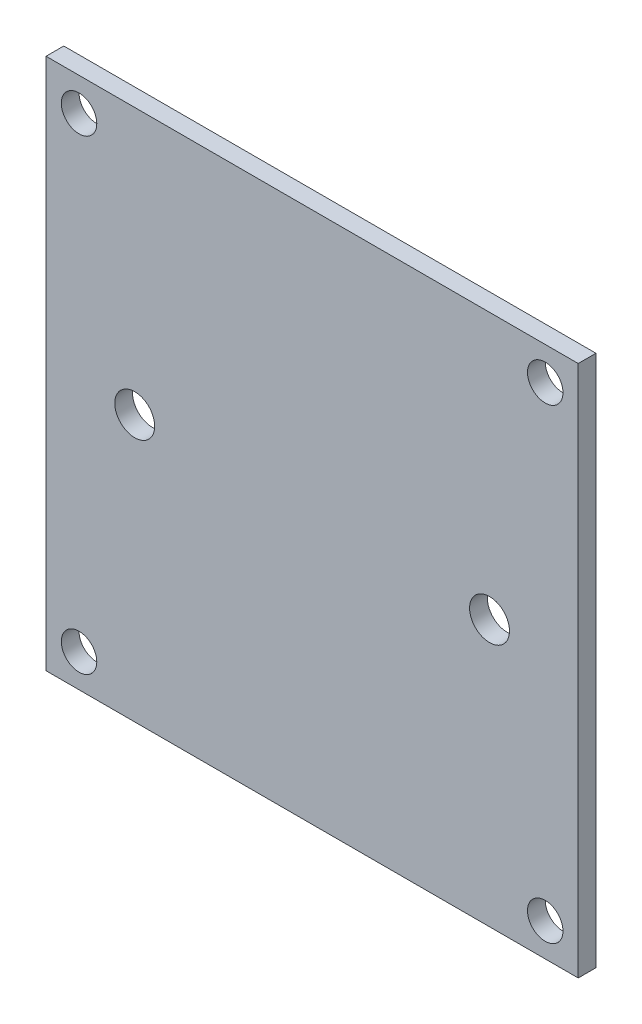
ISO-10303-21;
HEADER;
FILE_DESCRIPTION(('STEP AP214'),'2;1');
FILE_NAME('part.step','',(''),(''),'','','');
FILE_SCHEMA(('AUTOMOTIVE_DESIGN { 1 0 10303 214 1 1 1 1 }'));
ENDSEC;
DATA;
#1=APPLICATION_CONTEXT('core data for automotive mechanical design processes');
#2=APPLICATION_PROTOCOL_DEFINITION('international standard','automotive_design',2000,#1);
#3=PRODUCT_CONTEXT('',#1,'mechanical');
#4=PRODUCT('Part','Part','',(#3));
#5=PRODUCT_RELATED_PRODUCT_CATEGORY('part','',(#4));
#6=PRODUCT_DEFINITION_FORMATION('','',#4);
#7=PRODUCT_DEFINITION_CONTEXT('part definition',#1,'design');
#8=PRODUCT_DEFINITION('design','',#6,#7);
#9=PRODUCT_DEFINITION_SHAPE('','',#8);
#10=(LENGTH_UNIT() NAMED_UNIT(*) SI_UNIT(.MILLI.,.METRE.));
#11=(NAMED_UNIT(*) PLANE_ANGLE_UNIT() SI_UNIT($,.RADIAN.));
#12=(NAMED_UNIT(*) SI_UNIT($,.STERADIAN.) SOLID_ANGLE_UNIT());
#13=UNCERTAINTY_MEASURE_WITH_UNIT(LENGTH_MEASURE(1.E-05),#10,'distance_accuracy_value','');
#14=(GEOMETRIC_REPRESENTATION_CONTEXT(3) GLOBAL_UNCERTAINTY_ASSIGNED_CONTEXT((#13)) GLOBAL_UNIT_ASSIGNED_CONTEXT((#10,
#11,#12)) REPRESENTATION_CONTEXT('',''));
#15=CARTESIAN_POINT('',(0.,0.,0.));
#16=DIRECTION('',(0.,0.,1.));
#17=DIRECTION('',(1.,0.,0.));
#18=AXIS2_PLACEMENT_3D('',#15,#16,#17);
#19=CARTESIAN_POINT('',(-15.,15.,1.));
#20=DIRECTION('',(1.,0.,0.));
#21=DIRECTION('',(0.,1.,0.));
#22=AXIS2_PLACEMENT_3D('',#19,#20,#21);
#23=PLANE('',#22);
#24=DIRECTION('',(0.,-1.,0.));
#25=VECTOR('',#24,1.);
#26=CARTESIAN_POINT('',(-15.,15.,0.));
#27=LINE('',#26,#25);
#28=CARTESIAN_POINT('',(-15.,15.,0.));
#29=VERTEX_POINT('',#28);
#30=CARTESIAN_POINT('',(-15.,-15.,0.));
#31=VERTEX_POINT('',#30);
#32=EDGE_CURVE('E95',#29,#31,#27,.T.);
#33=ORIENTED_EDGE('',*,*,#32,.T.);
#34=DIRECTION('',(0.,0.,-1.));
#35=VECTOR('',#34,1.);
#36=CARTESIAN_POINT('',(-15.,-15.,1.));
#37=LINE('',#36,#35);
#38=CARTESIAN_POINT('',(-15.,-15.,1.));
#39=VERTEX_POINT('',#38);
#40=EDGE_CURVE('E11',#39,#31,#37,.T.);
#41=ORIENTED_EDGE('',*,*,#40,.F.);
#42=DIRECTION('',(0.,-1.,0.));
#43=VECTOR('',#42,1.);
#44=CARTESIAN_POINT('',(-15.,15.,1.));
#45=LINE('',#44,#43);
#46=CARTESIAN_POINT('',(-15.,15.,1.));
#47=VERTEX_POINT('',#46);
#48=EDGE_CURVE('E83',#47,#39,#45,.T.);
#49=ORIENTED_EDGE('',*,*,#48,.F.);
#50=DIRECTION('',(0.,0.,-1.));
#51=VECTOR('',#50,1.);
#52=CARTESIAN_POINT('',(-15.,15.,1.));
#53=LINE('',#52,#51);
#54=EDGE_CURVE('E91',#47,#29,#53,.T.);
#55=ORIENTED_EDGE('',*,*,#54,.T.);
#56=EDGE_LOOP('',(#33,#41,#49,#55));
#57=FACE_BOUND('',#56,.T.);
#58=ADVANCED_FACE('F32',(#57),#23,.F.);
#59=CARTESIAN_POINT('',(15.,-15.,1.));
#60=DIRECTION('',(0.,1.,0.));
#61=DIRECTION('',(-1.,0.,0.));
#62=AXIS2_PLACEMENT_3D('',#59,#60,#61);
#63=PLANE('',#62);
#64=DIRECTION('',(1.,0.,0.));
#65=VECTOR('',#64,1.);
#66=CARTESIAN_POINT('',(15.,-15.,0.));
#67=LINE('',#66,#65);
#68=CARTESIAN_POINT('',(15.,-15.,0.));
#69=VERTEX_POINT('',#68);
#70=EDGE_CURVE('E87',#31,#69,#67,.T.);
#71=ORIENTED_EDGE('',*,*,#70,.T.);
#72=DIRECTION('',(0.,0.,-1.));
#73=VECTOR('',#72,1.);
#74=CARTESIAN_POINT('',(15.,-15.,1.));
#75=LINE('',#74,#73);
#76=CARTESIAN_POINT('',(15.,-15.,1.));
#77=VERTEX_POINT('',#76);
#78=EDGE_CURVE('E40',#77,#69,#75,.T.);
#79=ORIENTED_EDGE('',*,*,#78,.F.);
#80=DIRECTION('',(1.,0.,0.));
#81=VECTOR('',#80,1.);
#82=CARTESIAN_POINT('',(15.,-15.,1.));
#83=LINE('',#82,#81);
#84=EDGE_CURVE('E78',#39,#77,#83,.T.);
#85=ORIENTED_EDGE('',*,*,#84,.F.);
#86=ORIENTED_EDGE('',*,*,#40,.T.);
#87=EDGE_LOOP('',(#71,#79,#85,#86));
#88=FACE_BOUND('',#87,.T.);
#89=ADVANCED_FACE('F86',(#88),#63,.F.);
#90=CARTESIAN_POINT('',(15.,15.,1.));
#91=DIRECTION('',(-1.,0.,0.));
#92=DIRECTION('',(0.,-1.,0.));
#93=AXIS2_PLACEMENT_3D('',#90,#91,#92);
#94=PLANE('',#93);
#95=DIRECTION('',(0.,1.,0.));
#96=VECTOR('',#95,1.);
#97=CARTESIAN_POINT('',(15.,15.,0.));
#98=LINE('',#97,#96);
#99=CARTESIAN_POINT('',(15.,15.,0.));
#100=VERTEX_POINT('',#99);
#101=EDGE_CURVE('E65',#69,#100,#98,.T.);
#102=ORIENTED_EDGE('',*,*,#101,.T.);
#103=DIRECTION('',(0.,0.,-1.));
#104=VECTOR('',#103,1.);
#105=CARTESIAN_POINT('',(15.,15.,1.));
#106=LINE('',#105,#104);
#107=CARTESIAN_POINT('',(15.,15.,1.));
#108=VERTEX_POINT('',#107);
#109=EDGE_CURVE('E88',#108,#100,#106,.T.);
#110=ORIENTED_EDGE('',*,*,#109,.F.);
#111=DIRECTION('',(0.,1.,0.));
#112=VECTOR('',#111,1.);
#113=CARTESIAN_POINT('',(15.,15.,1.));
#114=LINE('',#113,#112);
#115=EDGE_CURVE('E81',#77,#108,#114,.T.);
#116=ORIENTED_EDGE('',*,*,#115,.F.);
#117=ORIENTED_EDGE('',*,*,#78,.T.);
#118=EDGE_LOOP('',(#102,#110,#116,#117));
#119=FACE_BOUND('',#118,.T.);
#120=ADVANCED_FACE('F89',(#119),#94,.F.);
#121=CARTESIAN_POINT('',(15.,15.,1.));
#122=DIRECTION('',(0.,-1.,0.));
#123=DIRECTION('',(1.,0.,0.));
#124=AXIS2_PLACEMENT_3D('',#121,#122,#123);
#125=PLANE('',#124);
#126=DIRECTION('',(-1.,0.,0.));
#127=VECTOR('',#126,1.);
#128=CARTESIAN_POINT('',(15.,15.,0.));
#129=LINE('',#128,#127);
#130=EDGE_CURVE('E71',#100,#29,#129,.T.);
#131=ORIENTED_EDGE('',*,*,#130,.T.);
#132=ORIENTED_EDGE('',*,*,#54,.F.);
#133=DIRECTION('',(-1.,0.,0.));
#134=VECTOR('',#133,1.);
#135=CARTESIAN_POINT('',(15.,15.,1.));
#136=LINE('',#135,#134);
#137=EDGE_CURVE('E48',#108,#47,#136,.T.);
#138=ORIENTED_EDGE('',*,*,#137,.F.);
#139=ORIENTED_EDGE('',*,*,#109,.T.);
#140=EDGE_LOOP('',(#131,#132,#138,#139));
#141=FACE_BOUND('',#140,.T.);
#142=ADVANCED_FACE('F103',(#141),#125,.F.);
#143=CARTESIAN_POINT('',(0.,0.,1.));
#144=DIRECTION('',(0.,0.,-1.));
#145=DIRECTION('',(-1.,0.,0.));
#146=AXIS2_PLACEMENT_3D('',#143,#144,#145);
#147=PLANE('',#146);
#148=CARTESIAN_POINT('',(13.14,13.14,1.));
#149=DIRECTION('',(0.,0.,1.));
#150=DIRECTION('',(1.,0.,0.));
#151=AXIS2_PLACEMENT_3D('',#148,#149,#150);
#152=CIRCLE('',#151,1.);
#153=CARTESIAN_POINT('',(14.14,13.14,1.));
#154=VERTEX_POINT('',#153);
#155=EDGE_CURVE('E134',#154,#154,#152,.T.);
#156=ORIENTED_EDGE('',*,*,#155,.F.);
#157=EDGE_LOOP('',(#156));
#158=FACE_BOUND('',#157,.T.);
#159=CARTESIAN_POINT('',(13.14,-13.14,1.));
#160=DIRECTION('',(0.,0.,1.));
#161=DIRECTION('',(1.,0.,0.));
#162=AXIS2_PLACEMENT_3D('',#159,#160,#161);
#163=CIRCLE('',#162,0.999999999999999);
#164=CARTESIAN_POINT('',(14.14,-13.14,1.));
#165=VERTEX_POINT('',#164);
#166=EDGE_CURVE('E128',#165,#165,#163,.T.);
#167=ORIENTED_EDGE('',*,*,#166,.F.);
#168=EDGE_LOOP('',(#167));
#169=FACE_BOUND('',#168,.T.);
#170=CARTESIAN_POINT('',(-13.14,-13.14,1.));
#171=DIRECTION('',(0.,0.,1.));
#172=DIRECTION('',(1.,0.,0.));
#173=AXIS2_PLACEMENT_3D('',#170,#171,#172);
#174=CIRCLE('',#173,1.);
#175=CARTESIAN_POINT('',(-12.14,-13.14,1.));
#176=VERTEX_POINT('',#175);
#177=EDGE_CURVE('E122',#176,#176,#174,.T.);
#178=ORIENTED_EDGE('',*,*,#177,.F.);
#179=EDGE_LOOP('',(#178));
#180=FACE_BOUND('',#179,.T.);
#181=CARTESIAN_POINT('',(10.,0.,1.));
#182=DIRECTION('',(0.,0.,1.));
#183=DIRECTION('',(1.,0.,0.));
#184=AXIS2_PLACEMENT_3D('',#181,#182,#183);
#185=CIRCLE('',#184,1.125);
#186=CARTESIAN_POINT('',(11.125,0.,1.));
#187=VERTEX_POINT('',#186);
#188=EDGE_CURVE('E115',#187,#187,#185,.T.);
#189=ORIENTED_EDGE('',*,*,#188,.F.);
#190=EDGE_LOOP('',(#189));
#191=FACE_BOUND('',#190,.T.);
#192=CARTESIAN_POINT('',(-10.,0.,1.));
#193=DIRECTION('',(0.,0.,1.));
#194=DIRECTION('',(1.,0.,0.));
#195=AXIS2_PLACEMENT_3D('',#192,#193,#194);
#196=CIRCLE('',#195,1.125);
#197=CARTESIAN_POINT('',(-8.875,0.,1.));
#198=VERTEX_POINT('',#197);
#199=EDGE_CURVE('E139',#198,#198,#196,.T.);
#200=ORIENTED_EDGE('',*,*,#199,.F.);
#201=EDGE_LOOP('',(#200));
#202=FACE_BOUND('',#201,.T.);
#203=CARTESIAN_POINT('',(-13.14,13.14,1.));
#204=DIRECTION('',(0.,0.,1.));
#205=DIRECTION('',(1.,0.,0.));
#206=AXIS2_PLACEMENT_3D('',#203,#204,#205);
#207=CIRCLE('',#206,1.);
#208=CARTESIAN_POINT('',(-12.14,13.14,1.));
#209=VERTEX_POINT('',#208);
#210=EDGE_CURVE('E109',#209,#209,#207,.T.);
#211=ORIENTED_EDGE('',*,*,#210,.F.);
#212=EDGE_LOOP('',(#211));
#213=FACE_BOUND('',#212,.T.);
#214=ORIENTED_EDGE('',*,*,#48,.T.);
#215=ORIENTED_EDGE('',*,*,#84,.T.);
#216=ORIENTED_EDGE('',*,*,#115,.T.);
#217=ORIENTED_EDGE('',*,*,#137,.T.);
#218=EDGE_LOOP('',(#214,#215,#216,#217));
#219=FACE_BOUND('',#218,.T.);
#220=ADVANCED_FACE('F79',(#158,#169,#180,#191,#202,#213,#219),#147,.F.);
#221=CARTESIAN_POINT('',(0.,0.,0.));
#222=DIRECTION('',(0.,0.,-1.));
#223=DIRECTION('',(-1.,0.,0.));
#224=AXIS2_PLACEMENT_3D('',#221,#222,#223);
#225=PLANE('',#224);
#226=CARTESIAN_POINT('',(13.14,13.14,0.));
#227=DIRECTION('',(0.,0.,1.));
#228=DIRECTION('',(1.,0.,0.));
#229=AXIS2_PLACEMENT_3D('',#226,#227,#228);
#230=CIRCLE('',#229,1.);
#231=CARTESIAN_POINT('',(14.14,13.14,0.));
#232=VERTEX_POINT('',#231);
#233=EDGE_CURVE('E112',#232,#232,#230,.T.);
#234=ORIENTED_EDGE('',*,*,#233,.T.);
#235=EDGE_LOOP('',(#234));
#236=FACE_BOUND('',#235,.T.);
#237=CARTESIAN_POINT('',(13.14,-13.14,0.));
#238=DIRECTION('',(0.,0.,1.));
#239=DIRECTION('',(1.,0.,0.));
#240=AXIS2_PLACEMENT_3D('',#237,#238,#239);
#241=CIRCLE('',#240,0.999999999999999);
#242=CARTESIAN_POINT('',(14.14,-13.14,0.));
#243=VERTEX_POINT('',#242);
#244=EDGE_CURVE('E131',#243,#243,#241,.T.);
#245=ORIENTED_EDGE('',*,*,#244,.T.);
#246=EDGE_LOOP('',(#245));
#247=FACE_BOUND('',#246,.T.);
#248=CARTESIAN_POINT('',(-13.14,-13.14,0.));
#249=DIRECTION('',(0.,0.,1.));
#250=DIRECTION('',(1.,0.,0.));
#251=AXIS2_PLACEMENT_3D('',#248,#249,#250);
#252=CIRCLE('',#251,1.);
#253=CARTESIAN_POINT('',(-12.14,-13.14,0.));
#254=VERTEX_POINT('',#253);
#255=EDGE_CURVE('E125',#254,#254,#252,.T.);
#256=ORIENTED_EDGE('',*,*,#255,.T.);
#257=EDGE_LOOP('',(#256));
#258=FACE_BOUND('',#257,.T.);
#259=CARTESIAN_POINT('',(10.,0.,0.));
#260=DIRECTION('',(0.,0.,1.));
#261=DIRECTION('',(1.,0.,0.));
#262=AXIS2_PLACEMENT_3D('',#259,#260,#261);
#263=CIRCLE('',#262,1.125);
#264=CARTESIAN_POINT('',(11.125,0.,0.));
#265=VERTEX_POINT('',#264);
#266=EDGE_CURVE('E118',#265,#265,#263,.T.);
#267=ORIENTED_EDGE('',*,*,#266,.T.);
#268=EDGE_LOOP('',(#267));
#269=FACE_BOUND('',#268,.T.);
#270=CARTESIAN_POINT('',(-10.,0.,0.));
#271=DIRECTION('',(0.,0.,1.));
#272=DIRECTION('',(1.,0.,0.));
#273=AXIS2_PLACEMENT_3D('',#270,#271,#272);
#274=CIRCLE('',#273,1.125);
#275=CARTESIAN_POINT('',(-8.875,0.,0.));
#276=VERTEX_POINT('',#275);
#277=EDGE_CURVE('E119',#276,#276,#274,.T.);
#278=ORIENTED_EDGE('',*,*,#277,.T.);
#279=EDGE_LOOP('',(#278));
#280=FACE_BOUND('',#279,.T.);
#281=CARTESIAN_POINT('',(-13.14,13.14,0.));
#282=DIRECTION('',(0.,0.,1.));
#283=DIRECTION('',(1.,0.,0.));
#284=AXIS2_PLACEMENT_3D('',#281,#282,#283);
#285=CIRCLE('',#284,1.);
#286=CARTESIAN_POINT('',(-12.14,13.14,0.));
#287=VERTEX_POINT('',#286);
#288=EDGE_CURVE('E98',#287,#287,#285,.T.);
#289=ORIENTED_EDGE('',*,*,#288,.T.);
#290=EDGE_LOOP('',(#289));
#291=FACE_BOUND('',#290,.T.);
#292=ORIENTED_EDGE('',*,*,#32,.F.);
#293=ORIENTED_EDGE('',*,*,#130,.F.);
#294=ORIENTED_EDGE('',*,*,#101,.F.);
#295=ORIENTED_EDGE('',*,*,#70,.F.);
#296=EDGE_LOOP('',(#292,#293,#294,#295));
#297=FACE_BOUND('',#296,.T.);
#298=ADVANCED_FACE('F106',(#236,#247,#258,#269,#280,#291,#297),#225,.T.);
#299=CARTESIAN_POINT('',(-13.14,13.14,0.));
#300=DIRECTION('',(0.,0.,1.));
#301=DIRECTION('',(1.,0.,0.));
#302=AXIS2_PLACEMENT_3D('',#299,#300,#301);
#303=CYLINDRICAL_SURFACE('',#302,1.);
#304=ORIENTED_EDGE('',*,*,#288,.F.);
#305=EDGE_LOOP('',(#304));
#306=FACE_BOUND('',#305,.T.);
#307=ORIENTED_EDGE('',*,*,#210,.T.);
#308=EDGE_LOOP('',(#307));
#309=FACE_BOUND('',#308,.T.);
#310=ADVANCED_FACE('F151',(#306,#309),#303,.F.);
#311=CARTESIAN_POINT('',(-10.,0.,0.));
#312=DIRECTION('',(0.,0.,1.));
#313=DIRECTION('',(1.,0.,0.));
#314=AXIS2_PLACEMENT_3D('',#311,#312,#313);
#315=CYLINDRICAL_SURFACE('',#314,1.125);
#316=ORIENTED_EDGE('',*,*,#277,.F.);
#317=EDGE_LOOP('',(#316));
#318=FACE_BOUND('',#317,.T.);
#319=ORIENTED_EDGE('',*,*,#199,.T.);
#320=EDGE_LOOP('',(#319));
#321=FACE_BOUND('',#320,.T.);
#322=ADVANCED_FACE('F147',(#318,#321),#315,.F.);
#323=CARTESIAN_POINT('',(10.,0.,0.));
#324=DIRECTION('',(0.,0.,1.));
#325=DIRECTION('',(1.,0.,0.));
#326=AXIS2_PLACEMENT_3D('',#323,#324,#325);
#327=CYLINDRICAL_SURFACE('',#326,1.125);
#328=ORIENTED_EDGE('',*,*,#266,.F.);
#329=EDGE_LOOP('',(#328));
#330=FACE_BOUND('',#329,.T.);
#331=ORIENTED_EDGE('',*,*,#188,.T.);
#332=EDGE_LOOP('',(#331));
#333=FACE_BOUND('',#332,.T.);
#334=ADVANCED_FACE('F150',(#330,#333),#327,.F.);
#335=CARTESIAN_POINT('',(-13.14,-13.14,0.));
#336=DIRECTION('',(0.,0.,1.));
#337=DIRECTION('',(1.,0.,0.));
#338=AXIS2_PLACEMENT_3D('',#335,#336,#337);
#339=CYLINDRICAL_SURFACE('',#338,1.);
#340=ORIENTED_EDGE('',*,*,#255,.F.);
#341=EDGE_LOOP('',(#340));
#342=FACE_BOUND('',#341,.T.);
#343=ORIENTED_EDGE('',*,*,#177,.T.);
#344=EDGE_LOOP('',(#343));
#345=FACE_BOUND('',#344,.T.);
#346=ADVANCED_FACE('F212',(#342,#345),#339,.F.);
#347=CARTESIAN_POINT('',(13.14,-13.14,0.));
#348=DIRECTION('',(0.,0.,1.));
#349=DIRECTION('',(1.,0.,0.));
#350=AXIS2_PLACEMENT_3D('',#347,#348,#349);
#351=CYLINDRICAL_SURFACE('',#350,0.999999999999999);
#352=ORIENTED_EDGE('',*,*,#244,.F.);
#353=EDGE_LOOP('',(#352));
#354=FACE_BOUND('',#353,.T.);
#355=ORIENTED_EDGE('',*,*,#166,.T.);
#356=EDGE_LOOP('',(#355));
#357=FACE_BOUND('',#356,.T.);
#358=ADVANCED_FACE('F221',(#354,#357),#351,.F.);
#359=CARTESIAN_POINT('',(13.14,13.14,0.));
#360=DIRECTION('',(0.,0.,1.));
#361=DIRECTION('',(1.,0.,0.));
#362=AXIS2_PLACEMENT_3D('',#359,#360,#361);
#363=CYLINDRICAL_SURFACE('',#362,1.);
#364=ORIENTED_EDGE('',*,*,#233,.F.);
#365=EDGE_LOOP('',(#364));
#366=FACE_BOUND('',#365,.T.);
#367=ORIENTED_EDGE('',*,*,#155,.T.);
#368=EDGE_LOOP('',(#367));
#369=FACE_BOUND('',#368,.T.);
#370=ADVANCED_FACE('F231',(#366,#369),#363,.F.);
#371=CLOSED_SHELL('',(#58,#89,#120,#142,#220,#298,#310,#322,#334,#346,#358,#370));
#372=MANIFOLD_SOLID_BREP('B2',#371);
#373=ADVANCED_BREP_SHAPE_REPRESENTATION('',(#18,#372),#14);
#374=SHAPE_DEFINITION_REPRESENTATION(#9,#373);
ENDSEC;
END-ISO-10303-21;
